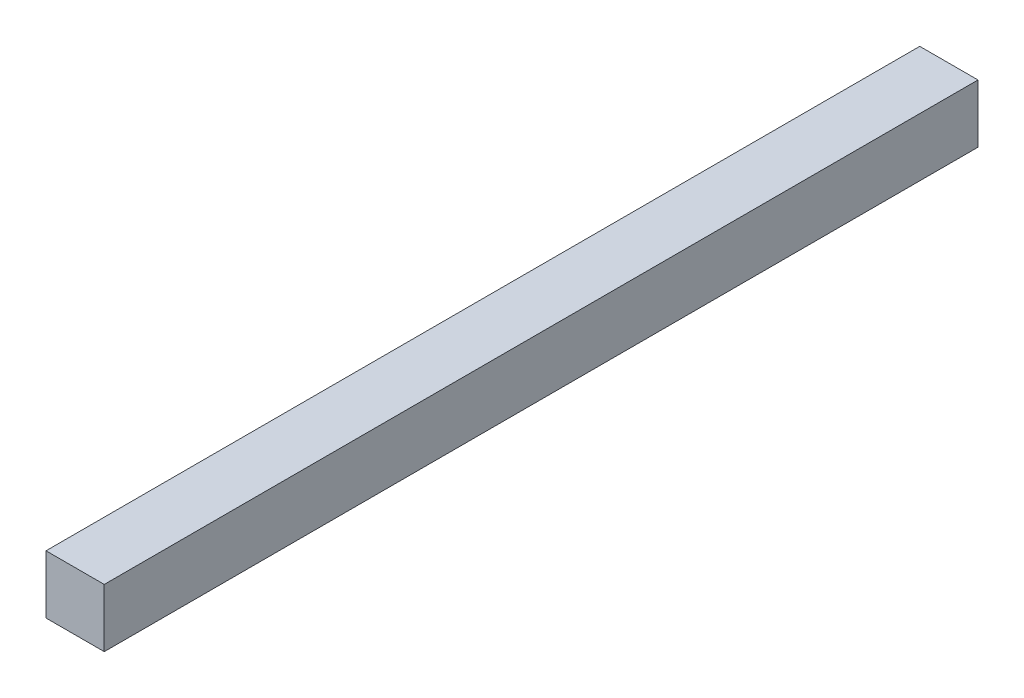
ISO-10303-21;
HEADER;
FILE_DESCRIPTION(('STEP AP214'),'2;1');
FILE_NAME('part.step','',(''),(''),'','','');
FILE_SCHEMA(('AUTOMOTIVE_DESIGN { 1 0 10303 214 1 1 1 1 }'));
ENDSEC;
DATA;
#1=APPLICATION_CONTEXT('core data for automotive mechanical design processes');
#2=APPLICATION_PROTOCOL_DEFINITION('international standard','automotive_design',2000,#1);
#3=PRODUCT_CONTEXT('',#1,'mechanical');
#4=PRODUCT('Part','Part','',(#3));
#5=PRODUCT_RELATED_PRODUCT_CATEGORY('part','',(#4));
#6=PRODUCT_DEFINITION_FORMATION('','',#4);
#7=PRODUCT_DEFINITION_CONTEXT('part definition',#1,'design');
#8=PRODUCT_DEFINITION('design','',#6,#7);
#9=PRODUCT_DEFINITION_SHAPE('','',#8);
#10=(LENGTH_UNIT() NAMED_UNIT(*) SI_UNIT(.MILLI.,.METRE.));
#11=(NAMED_UNIT(*) PLANE_ANGLE_UNIT() SI_UNIT($,.RADIAN.));
#12=(NAMED_UNIT(*) SI_UNIT($,.STERADIAN.) SOLID_ANGLE_UNIT());
#13=UNCERTAINTY_MEASURE_WITH_UNIT(LENGTH_MEASURE(1.E-05),#10,'distance_accuracy_value','');
#14=(GEOMETRIC_REPRESENTATION_CONTEXT(3) GLOBAL_UNCERTAINTY_ASSIGNED_CONTEXT((#13)) GLOBAL_UNIT_ASSIGNED_CONTEXT((#10,
#11,#12)) REPRESENTATION_CONTEXT('',''));
#15=CARTESIAN_POINT('',(0.,0.,0.));
#16=DIRECTION('',(0.,0.,1.));
#17=DIRECTION('',(1.,0.,0.));
#18=AXIS2_PLACEMENT_3D('',#15,#16,#17);
#19=CARTESIAN_POINT('',(12.7,-12.7,381.));
#20=DIRECTION('',(-1.,0.,0.));
#21=DIRECTION('',(0.,0.,1.));
#22=AXIS2_PLACEMENT_3D('',#19,#20,#21);
#23=PLANE('',#22);
#24=DIRECTION('',(0.,1.,0.));
#25=VECTOR('',#24,1.);
#26=CARTESIAN_POINT('',(12.7,-12.7,0.));
#27=LINE('',#26,#25);
#28=CARTESIAN_POINT('',(12.7,-12.7,0.));
#29=VERTEX_POINT('',#28);
#30=CARTESIAN_POINT('',(12.7,12.7,0.));
#31=VERTEX_POINT('',#30);
#32=EDGE_CURVE('E97',#29,#31,#27,.T.);
#33=ORIENTED_EDGE('',*,*,#32,.T.);
#34=DIRECTION('',(0.,0.,-1.));
#35=VECTOR('',#34,1.);
#36=CARTESIAN_POINT('',(12.7,12.7,381.));
#37=LINE('',#36,#35);
#38=CARTESIAN_POINT('',(12.7,12.7,381.));
#39=VERTEX_POINT('',#38);
#40=EDGE_CURVE('E11',#39,#31,#37,.T.);
#41=ORIENTED_EDGE('',*,*,#40,.F.);
#42=DIRECTION('',(0.,1.,0.));
#43=VECTOR('',#42,1.);
#44=CARTESIAN_POINT('',(12.7,-12.7,381.));
#45=LINE('',#44,#43);
#46=CARTESIAN_POINT('',(12.7,-12.7,381.));
#47=VERTEX_POINT('',#46);
#48=EDGE_CURVE('E85',#47,#39,#45,.T.);
#49=ORIENTED_EDGE('',*,*,#48,.F.);
#50=DIRECTION('',(0.,0.,-1.));
#51=VECTOR('',#50,1.);
#52=CARTESIAN_POINT('',(12.7,-12.7,381.));
#53=LINE('',#52,#51);
#54=EDGE_CURVE('E93',#47,#29,#53,.T.);
#55=ORIENTED_EDGE('',*,*,#54,.T.);
#56=EDGE_LOOP('',(#33,#41,#49,#55));
#57=FACE_BOUND('',#56,.T.);
#58=ADVANCED_FACE('F34',(#57),#23,.F.);
#59=CARTESIAN_POINT('',(-12.7,12.7,381.));
#60=DIRECTION('',(0.,-1.,0.));
#61=DIRECTION('',(0.,0.,-1.));
#62=AXIS2_PLACEMENT_3D('',#59,#60,#61);
#63=PLANE('',#62);
#64=DIRECTION('',(-1.,0.,0.));
#65=VECTOR('',#64,1.);
#66=CARTESIAN_POINT('',(-12.7,12.7,0.));
#67=LINE('',#66,#65);
#68=CARTESIAN_POINT('',(-12.7,12.7,0.));
#69=VERTEX_POINT('',#68);
#70=EDGE_CURVE('E89',#31,#69,#67,.T.);
#71=ORIENTED_EDGE('',*,*,#70,.T.);
#72=DIRECTION('',(0.,0.,-1.));
#73=VECTOR('',#72,1.);
#74=CARTESIAN_POINT('',(-12.7,12.7,381.));
#75=LINE('',#74,#73);
#76=CARTESIAN_POINT('',(-12.7,12.7,381.));
#77=VERTEX_POINT('',#76);
#78=EDGE_CURVE('E42',#77,#69,#75,.T.);
#79=ORIENTED_EDGE('',*,*,#78,.F.);
#80=DIRECTION('',(-1.,0.,0.));
#81=VECTOR('',#80,1.);
#82=CARTESIAN_POINT('',(-12.7,12.7,381.));
#83=LINE('',#82,#81);
#84=EDGE_CURVE('E80',#39,#77,#83,.T.);
#85=ORIENTED_EDGE('',*,*,#84,.F.);
#86=ORIENTED_EDGE('',*,*,#40,.T.);
#87=EDGE_LOOP('',(#71,#79,#85,#86));
#88=FACE_BOUND('',#87,.T.);
#89=ADVANCED_FACE('F88',(#88),#63,.F.);
#90=CARTESIAN_POINT('',(-12.7,-12.7,381.));
#91=DIRECTION('',(1.,0.,0.));
#92=DIRECTION('',(0.,0.,-1.));
#93=AXIS2_PLACEMENT_3D('',#90,#91,#92);
#94=PLANE('',#93);
#95=DIRECTION('',(0.,-1.,0.));
#96=VECTOR('',#95,1.);
#97=CARTESIAN_POINT('',(-12.7,-12.7,0.));
#98=LINE('',#97,#96);
#99=CARTESIAN_POINT('',(-12.7,-12.7,0.));
#100=VERTEX_POINT('',#99);
#101=EDGE_CURVE('E67',#69,#100,#98,.T.);
#102=ORIENTED_EDGE('',*,*,#101,.T.);
#103=DIRECTION('',(0.,0.,-1.));
#104=VECTOR('',#103,1.);
#105=CARTESIAN_POINT('',(-12.7,-12.7,381.));
#106=LINE('',#105,#104);
#107=CARTESIAN_POINT('',(-12.7,-12.7,381.));
#108=VERTEX_POINT('',#107);
#109=EDGE_CURVE('E90',#108,#100,#106,.T.);
#110=ORIENTED_EDGE('',*,*,#109,.F.);
#111=DIRECTION('',(0.,-1.,0.));
#112=VECTOR('',#111,1.);
#113=CARTESIAN_POINT('',(-12.7,-12.7,381.));
#114=LINE('',#113,#112);
#115=EDGE_CURVE('E83',#77,#108,#114,.T.);
#116=ORIENTED_EDGE('',*,*,#115,.F.);
#117=ORIENTED_EDGE('',*,*,#78,.T.);
#118=EDGE_LOOP('',(#102,#110,#116,#117));
#119=FACE_BOUND('',#118,.T.);
#120=ADVANCED_FACE('F91',(#119),#94,.F.);
#121=CARTESIAN_POINT('',(-12.7,-12.7,381.));
#122=DIRECTION('',(0.,1.,0.));
#123=DIRECTION('',(0.,0.,1.));
#124=AXIS2_PLACEMENT_3D('',#121,#122,#123);
#125=PLANE('',#124);
#126=DIRECTION('',(1.,0.,0.));
#127=VECTOR('',#126,1.);
#128=CARTESIAN_POINT('',(-12.7,-12.7,0.));
#129=LINE('',#128,#127);
#130=EDGE_CURVE('E73',#100,#29,#129,.T.);
#131=ORIENTED_EDGE('',*,*,#130,.T.);
#132=ORIENTED_EDGE('',*,*,#54,.F.);
#133=DIRECTION('',(1.,0.,0.));
#134=VECTOR('',#133,1.);
#135=CARTESIAN_POINT('',(-12.7,-12.7,381.));
#136=LINE('',#135,#134);
#137=EDGE_CURVE('E50',#108,#47,#136,.T.);
#138=ORIENTED_EDGE('',*,*,#137,.F.);
#139=ORIENTED_EDGE('',*,*,#109,.T.);
#140=EDGE_LOOP('',(#131,#132,#138,#139));
#141=FACE_BOUND('',#140,.T.);
#142=ADVANCED_FACE('F104',(#141),#125,.F.);
#143=CARTESIAN_POINT('',(0.,0.,381.));
#144=DIRECTION('',(0.,0.,-1.));
#145=DIRECTION('',(-1.,0.,0.));
#146=AXIS2_PLACEMENT_3D('',#143,#144,#145);
#147=PLANE('',#146);
#148=ORIENTED_EDGE('',*,*,#48,.T.);
#149=ORIENTED_EDGE('',*,*,#84,.T.);
#150=ORIENTED_EDGE('',*,*,#115,.T.);
#151=ORIENTED_EDGE('',*,*,#137,.T.);
#152=EDGE_LOOP('',(#148,#149,#150,#151));
#153=FACE_BOUND('',#152,.T.);
#154=ADVANCED_FACE('F81',(#153),#147,.F.);
#155=CARTESIAN_POINT('',(0.,0.,0.));
#156=DIRECTION('',(0.,0.,-1.));
#157=DIRECTION('',(-1.,0.,0.));
#158=AXIS2_PLACEMENT_3D('',#155,#156,#157);
#159=PLANE('',#158);
#160=ORIENTED_EDGE('',*,*,#32,.F.);
#161=ORIENTED_EDGE('',*,*,#130,.F.);
#162=ORIENTED_EDGE('',*,*,#101,.F.);
#163=ORIENTED_EDGE('',*,*,#70,.F.);
#164=EDGE_LOOP('',(#160,#161,#162,#163));
#165=FACE_BOUND('',#164,.T.);
#166=ADVANCED_FACE('F107',(#165),#159,.T.);
#167=CLOSED_SHELL('',(#58,#89,#120,#142,#154,#166));
#168=MANIFOLD_SOLID_BREP('B2',#167);
#169=ADVANCED_BREP_SHAPE_REPRESENTATION('',(#18,#168),#14);
#170=SHAPE_DEFINITION_REPRESENTATION(#9,#169);
ENDSEC;
END-ISO-10303-21;
